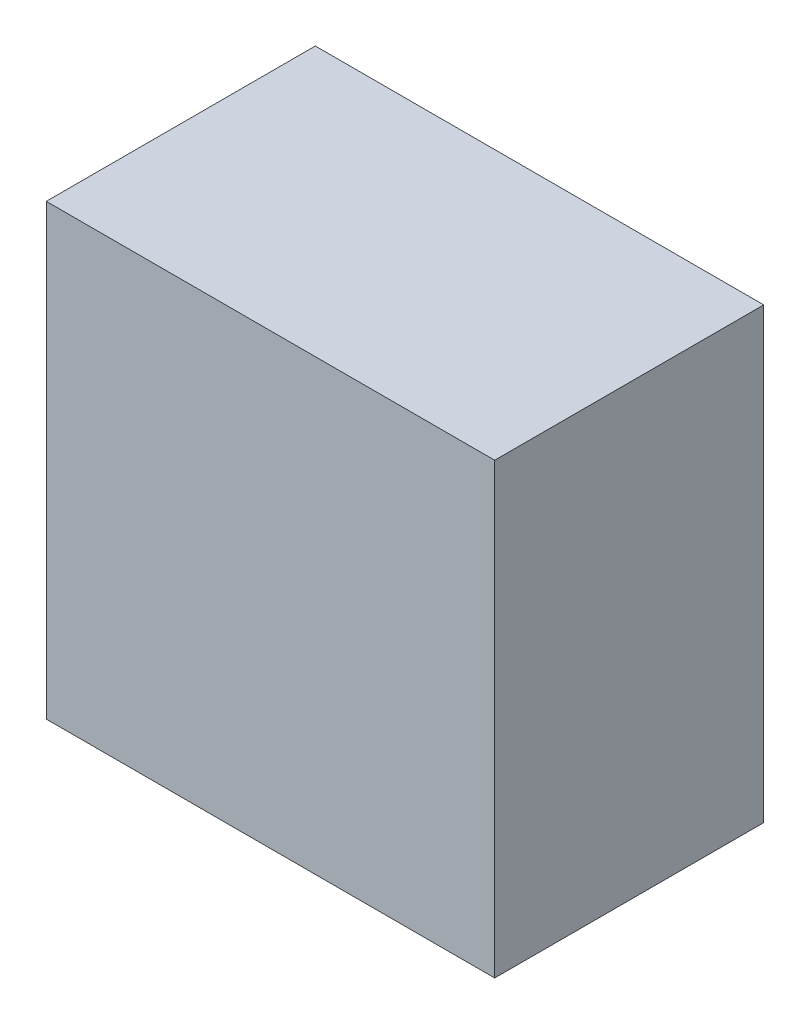
ISO-10303-21;
HEADER;
FILE_DESCRIPTION(('STEP AP214'),'2;1');
FILE_NAME('part.step','',(''),(''),'','','');
FILE_SCHEMA(('AUTOMOTIVE_DESIGN { 1 0 10303 214 1 1 1 1 }'));
ENDSEC;
DATA;
#1=APPLICATION_CONTEXT('core data for automotive mechanical design processes');
#2=APPLICATION_PROTOCOL_DEFINITION('international standard','automotive_design',2000,#1);
#3=PRODUCT_CONTEXT('',#1,'mechanical');
#4=PRODUCT('Part','Part','',(#3));
#5=PRODUCT_RELATED_PRODUCT_CATEGORY('part','',(#4));
#6=PRODUCT_DEFINITION_FORMATION('','',#4);
#7=PRODUCT_DEFINITION_CONTEXT('part definition',#1,'design');
#8=PRODUCT_DEFINITION('design','',#6,#7);
#9=PRODUCT_DEFINITION_SHAPE('','',#8);
#10=(LENGTH_UNIT() NAMED_UNIT(*) SI_UNIT(.MILLI.,.METRE.));
#11=(NAMED_UNIT(*) PLANE_ANGLE_UNIT() SI_UNIT($,.RADIAN.));
#12=(NAMED_UNIT(*) SI_UNIT($,.STERADIAN.) SOLID_ANGLE_UNIT());
#13=UNCERTAINTY_MEASURE_WITH_UNIT(LENGTH_MEASURE(1.E-05),#10,'distance_accuracy_value','');
#14=(GEOMETRIC_REPRESENTATION_CONTEXT(3) GLOBAL_UNCERTAINTY_ASSIGNED_CONTEXT((#13)) GLOBAL_UNIT_ASSIGNED_CONTEXT((#10,
#11,#12)) REPRESENTATION_CONTEXT('',''));
#15=CARTESIAN_POINT('',(0.,0.,0.));
#16=DIRECTION('',(0.,0.,1.));
#17=DIRECTION('',(1.,0.,0.));
#18=AXIS2_PLACEMENT_3D('',#15,#16,#17);
#19=CARTESIAN_POINT('',(7.80141843971632,-21.6312056737589,-30.));
#20=DIRECTION('',(-1.,0.,0.));
#21=DIRECTION('',(0.,0.,1.));
#22=AXIS2_PLACEMENT_3D('',#19,#20,#21);
#23=PLANE('',#22);
#24=DIRECTION('',(0.,-1.,0.));
#25=VECTOR('',#24,1.);
#26=CARTESIAN_POINT('',(7.80141843971632,-21.6312056737589,0.));
#27=LINE('',#26,#25);
#28=CARTESIAN_POINT('',(7.80141843971632,28.3687943262411,0.));
#29=VERTEX_POINT('',#28);
#30=CARTESIAN_POINT('',(7.80141843971632,-21.6312056737589,0.));
#31=VERTEX_POINT('',#30);
#32=EDGE_CURVE('E140',#29,#31,#27,.T.);
#33=ORIENTED_EDGE('',*,*,#32,.F.);
#34=DIRECTION('',(0.,0.,1.));
#35=VECTOR('',#34,1.);
#36=CARTESIAN_POINT('',(7.80141843971632,28.3687943262411,-30.));
#37=LINE('',#36,#35);
#38=CARTESIAN_POINT('',(7.80141843971632,28.3687943262411,-30.));
#39=VERTEX_POINT('',#38);
#40=EDGE_CURVE('E11',#39,#29,#37,.T.);
#41=ORIENTED_EDGE('',*,*,#40,.F.);
#42=DIRECTION('',(0.,-1.,0.));
#43=VECTOR('',#42,1.);
#44=CARTESIAN_POINT('',(7.80141843971632,-21.6312056737589,-30.));
#45=LINE('',#44,#43);
#46=CARTESIAN_POINT('',(7.80141843971632,-21.6312056737589,-30.));
#47=VERTEX_POINT('',#46);
#48=EDGE_CURVE('E144',#39,#47,#45,.T.);
#49=ORIENTED_EDGE('',*,*,#48,.T.);
#50=DIRECTION('',(0.,0.,1.));
#51=VECTOR('',#50,1.);
#52=CARTESIAN_POINT('',(7.80141843971632,-21.6312056737589,-30.));
#53=LINE('',#52,#51);
#54=EDGE_CURVE('E36',#47,#31,#53,.T.);
#55=ORIENTED_EDGE('',*,*,#54,.T.);
#56=EDGE_LOOP('',(#33,#41,#49,#55));
#57=FACE_BOUND('',#56,.T.);
#58=ADVANCED_FACE('F33',(#57),#23,.T.);
#59=CARTESIAN_POINT('',(7.80141843971632,28.3687943262411,-30.));
#60=DIRECTION('',(0.,1.,0.));
#61=DIRECTION('',(0.,0.,1.));
#62=AXIS2_PLACEMENT_3D('',#59,#60,#61);
#63=PLANE('',#62);
#64=DIRECTION('',(-1.,0.,0.));
#65=VECTOR('',#64,1.);
#66=CARTESIAN_POINT('',(7.80141843971632,28.3687943262411,0.));
#67=LINE('',#66,#65);
#68=CARTESIAN_POINT('',(57.8014184397163,28.3687943262411,0.));
#69=VERTEX_POINT('',#68);
#70=EDGE_CURVE('E147',#69,#29,#67,.T.);
#71=ORIENTED_EDGE('',*,*,#70,.F.);
#72=DIRECTION('',(0.,0.,1.));
#73=VECTOR('',#72,1.);
#74=CARTESIAN_POINT('',(57.8014184397163,28.3687943262411,-30.));
#75=LINE('',#74,#73);
#76=CARTESIAN_POINT('',(57.8014184397163,28.3687943262411,-30.));
#77=VERTEX_POINT('',#76);
#78=EDGE_CURVE('E41',#77,#69,#75,.T.);
#79=ORIENTED_EDGE('',*,*,#78,.F.);
#80=DIRECTION('',(-1.,0.,0.));
#81=VECTOR('',#80,1.);
#82=CARTESIAN_POINT('',(7.80141843971632,28.3687943262411,-30.));
#83=LINE('',#82,#81);
#84=EDGE_CURVE('E152',#77,#39,#83,.T.);
#85=ORIENTED_EDGE('',*,*,#84,.T.);
#86=ORIENTED_EDGE('',*,*,#40,.T.);
#87=EDGE_LOOP('',(#71,#79,#85,#86));
#88=FACE_BOUND('',#87,.T.);
#89=ADVANCED_FACE('F169',(#88),#63,.T.);
#90=CARTESIAN_POINT('',(57.8014184397163,-21.6312056737589,-30.));
#91=DIRECTION('',(1.,0.,0.));
#92=DIRECTION('',(0.,0.,-1.));
#93=AXIS2_PLACEMENT_3D('',#90,#91,#92);
#94=PLANE('',#93);
#95=DIRECTION('',(0.,1.,0.));
#96=VECTOR('',#95,1.);
#97=CARTESIAN_POINT('',(57.8014184397163,-21.6312056737589,0.));
#98=LINE('',#97,#96);
#99=CARTESIAN_POINT('',(57.8014184397163,-21.6312056737589,0.));
#100=VERTEX_POINT('',#99);
#101=EDGE_CURVE('E159',#100,#69,#98,.T.);
#102=ORIENTED_EDGE('',*,*,#101,.F.);
#103=DIRECTION('',(0.,0.,1.));
#104=VECTOR('',#103,1.);
#105=CARTESIAN_POINT('',(57.8014184397163,-21.6312056737589,-30.));
#106=LINE('',#105,#104);
#107=CARTESIAN_POINT('',(57.8014184397163,-21.6312056737589,-30.));
#108=VERTEX_POINT('',#107);
#109=EDGE_CURVE('E164',#108,#100,#106,.T.);
#110=ORIENTED_EDGE('',*,*,#109,.F.);
#111=DIRECTION('',(0.,1.,0.));
#112=VECTOR('',#111,1.);
#113=CARTESIAN_POINT('',(57.8014184397163,-21.6312056737589,-30.));
#114=LINE('',#113,#112);
#115=EDGE_CURVE('E149',#108,#77,#114,.T.);
#116=ORIENTED_EDGE('',*,*,#115,.T.);
#117=ORIENTED_EDGE('',*,*,#78,.T.);
#118=EDGE_LOOP('',(#102,#110,#116,#117));
#119=FACE_BOUND('',#118,.T.);
#120=ADVANCED_FACE('F173',(#119),#94,.T.);
#121=CARTESIAN_POINT('',(7.80141843971632,-21.6312056737589,-30.));
#122=DIRECTION('',(0.,-1.,0.));
#123=DIRECTION('',(0.,0.,-1.));
#124=AXIS2_PLACEMENT_3D('',#121,#122,#123);
#125=PLANE('',#124);
#126=DIRECTION('',(1.,0.,0.));
#127=VECTOR('',#126,1.);
#128=CARTESIAN_POINT('',(7.80141843971632,-21.6312056737589,0.));
#129=LINE('',#128,#127);
#130=EDGE_CURVE('E156',#31,#100,#129,.T.);
#131=ORIENTED_EDGE('',*,*,#130,.F.);
#132=ORIENTED_EDGE('',*,*,#54,.F.);
#133=DIRECTION('',(1.,0.,0.));
#134=VECTOR('',#133,1.);
#135=CARTESIAN_POINT('',(7.80141843971632,-21.6312056737589,-30.));
#136=LINE('',#135,#134);
#137=EDGE_CURVE('E146',#47,#108,#136,.T.);
#138=ORIENTED_EDGE('',*,*,#137,.T.);
#139=ORIENTED_EDGE('',*,*,#109,.T.);
#140=EDGE_LOOP('',(#131,#132,#138,#139));
#141=FACE_BOUND('',#140,.T.);
#142=ADVANCED_FACE('F166',(#141),#125,.T.);
#143=CARTESIAN_POINT('',(0.,0.,-30.));
#144=DIRECTION('',(0.,0.,-1.));
#145=DIRECTION('',(-1.,0.,0.));
#146=AXIS2_PLACEMENT_3D('',#143,#144,#145);
#147=PLANE('',#146);
#148=DIRECTION('',(0.,1.,0.));
#149=VECTOR('',#148,1.);
#150=CARTESIAN_POINT('',(10.3014184397163,-19.1312056737589,-30.));
#151=LINE('',#150,#149);
#152=CARTESIAN_POINT('',(10.3014184397163,-19.1312056737589,-30.));
#153=VERTEX_POINT('',#152);
#154=CARTESIAN_POINT('',(10.3014184397163,25.8687943262411,-30.));
#155=VERTEX_POINT('',#154);
#156=EDGE_CURVE('E49',#153,#155,#151,.T.);
#157=ORIENTED_EDGE('',*,*,#156,.F.);
#158=DIRECTION('',(-1.,0.,0.));
#159=VECTOR('',#158,1.);
#160=CARTESIAN_POINT('',(10.3014184397163,-19.1312056737589,-30.));
#161=LINE('',#160,#159);
#162=CARTESIAN_POINT('',(55.3014184397163,-19.1312056737589,-30.));
#163=VERTEX_POINT('',#162);
#164=EDGE_CURVE('E125',#163,#153,#161,.T.);
#165=ORIENTED_EDGE('',*,*,#164,.F.);
#166=DIRECTION('',(0.,-1.,0.));
#167=VECTOR('',#166,1.);
#168=CARTESIAN_POINT('',(55.3014184397163,-19.1312056737589,-30.));
#169=LINE('',#168,#167);
#170=CARTESIAN_POINT('',(55.3014184397163,25.8687943262411,-30.));
#171=VERTEX_POINT('',#170);
#172=EDGE_CURVE('E128',#171,#163,#169,.T.);
#173=ORIENTED_EDGE('',*,*,#172,.F.);
#174=DIRECTION('',(1.,0.,0.));
#175=VECTOR('',#174,1.);
#176=CARTESIAN_POINT('',(10.3014184397163,25.8687943262411,-30.));
#177=LINE('',#176,#175);
#178=EDGE_CURVE('E134',#155,#171,#177,.T.);
#179=ORIENTED_EDGE('',*,*,#178,.F.);
#180=EDGE_LOOP('',(#157,#165,#173,#179));
#181=FACE_BOUND('',#180,.T.);
#182=ORIENTED_EDGE('',*,*,#48,.F.);
#183=ORIENTED_EDGE('',*,*,#84,.F.);
#184=ORIENTED_EDGE('',*,*,#115,.F.);
#185=ORIENTED_EDGE('',*,*,#137,.F.);
#186=EDGE_LOOP('',(#182,#183,#184,#185));
#187=FACE_BOUND('',#186,.T.);
#188=ADVANCED_FACE('F175',(#181,#187),#147,.T.);
#189=CARTESIAN_POINT('',(0.,0.,0.));
#190=DIRECTION('',(0.,0.,-1.));
#191=DIRECTION('',(-1.,0.,0.));
#192=AXIS2_PLACEMENT_3D('',#189,#190,#191);
#193=PLANE('',#192);
#194=ORIENTED_EDGE('',*,*,#32,.T.);
#195=ORIENTED_EDGE('',*,*,#130,.T.);
#196=ORIENTED_EDGE('',*,*,#101,.T.);
#197=ORIENTED_EDGE('',*,*,#70,.T.);
#198=EDGE_LOOP('',(#194,#195,#196,#197));
#199=FACE_BOUND('',#198,.T.);
#200=ADVANCED_FACE('F168',(#199),#193,.F.);
#201=CARTESIAN_POINT('',(10.3014184397163,-19.1312056737589,-3.));
#202=DIRECTION('',(-1.,0.,0.));
#203=DIRECTION('',(0.,0.,1.));
#204=AXIS2_PLACEMENT_3D('',#201,#202,#203);
#205=PLANE('',#204);
#206=ORIENTED_EDGE('',*,*,#156,.T.);
#207=DIRECTION('',(0.,0.,-1.));
#208=VECTOR('',#207,1.);
#209=CARTESIAN_POINT('',(10.3014184397163,25.8687943262411,-3.));
#210=LINE('',#209,#208);
#211=CARTESIAN_POINT('',(10.3014184397163,25.8687943262411,-3.));
#212=VERTEX_POINT('',#211);
#213=EDGE_CURVE('E103',#212,#155,#210,.T.);
#214=ORIENTED_EDGE('',*,*,#213,.F.);
#215=DIRECTION('',(0.,1.,0.));
#216=VECTOR('',#215,1.);
#217=CARTESIAN_POINT('',(10.3014184397163,-19.1312056737589,-3.));
#218=LINE('',#217,#216);
#219=CARTESIAN_POINT('',(10.3014184397163,-19.1312056737589,-3.));
#220=VERTEX_POINT('',#219);
#221=EDGE_CURVE('E107',#220,#212,#218,.T.);
#222=ORIENTED_EDGE('',*,*,#221,.F.);
#223=DIRECTION('',(0.,0.,-1.));
#224=VECTOR('',#223,1.);
#225=CARTESIAN_POINT('',(10.3014184397163,-19.1312056737589,-3.));
#226=LINE('',#225,#224);
#227=EDGE_CURVE('E138',#220,#153,#226,.T.);
#228=ORIENTED_EDGE('',*,*,#227,.T.);
#229=EDGE_LOOP('',(#206,#214,#222,#228));
#230=FACE_BOUND('',#229,.T.);
#231=ADVANCED_FACE('F105',(#230),#205,.F.);
#232=CARTESIAN_POINT('',(10.3014184397163,-19.1312056737589,-3.));
#233=DIRECTION('',(0.,-1.,0.));
#234=DIRECTION('',(1.,0.,0.));
#235=AXIS2_PLACEMENT_3D('',#232,#233,#234);
#236=PLANE('',#235);
#237=ORIENTED_EDGE('',*,*,#164,.T.);
#238=ORIENTED_EDGE('',*,*,#227,.F.);
#239=DIRECTION('',(-1.,0.,0.));
#240=VECTOR('',#239,1.);
#241=CARTESIAN_POINT('',(10.3014184397163,-19.1312056737589,-3.));
#242=LINE('',#241,#240);
#243=CARTESIAN_POINT('',(55.3014184397163,-19.1312056737589,-3.));
#244=VERTEX_POINT('',#243);
#245=EDGE_CURVE('E113',#244,#220,#242,.T.);
#246=ORIENTED_EDGE('',*,*,#245,.F.);
#247=DIRECTION('',(0.,0.,-1.));
#248=VECTOR('',#247,1.);
#249=CARTESIAN_POINT('',(55.3014184397163,-19.1312056737589,-3.));
#250=LINE('',#249,#248);
#251=EDGE_CURVE('E141',#244,#163,#250,.T.);
#252=ORIENTED_EDGE('',*,*,#251,.T.);
#253=EDGE_LOOP('',(#237,#238,#246,#252));
#254=FACE_BOUND('',#253,.T.);
#255=ADVANCED_FACE('F219',(#254),#236,.F.);
#256=CARTESIAN_POINT('',(55.3014184397163,-19.1312056737589,-3.));
#257=DIRECTION('',(1.,0.,0.));
#258=DIRECTION('',(0.,0.,-1.));
#259=AXIS2_PLACEMENT_3D('',#256,#257,#258);
#260=PLANE('',#259);
#261=ORIENTED_EDGE('',*,*,#172,.T.);
#262=ORIENTED_EDGE('',*,*,#251,.F.);
#263=DIRECTION('',(0.,-1.,0.));
#264=VECTOR('',#263,1.);
#265=CARTESIAN_POINT('',(55.3014184397163,-19.1312056737589,-3.));
#266=LINE('',#265,#264);
#267=CARTESIAN_POINT('',(55.3014184397163,25.8687943262411,-3.));
#268=VERTEX_POINT('',#267);
#269=EDGE_CURVE('E121',#268,#244,#266,.T.);
#270=ORIENTED_EDGE('',*,*,#269,.F.);
#271=DIRECTION('',(0.,0.,-1.));
#272=VECTOR('',#271,1.);
#273=CARTESIAN_POINT('',(55.3014184397163,25.8687943262411,-3.));
#274=LINE('',#273,#272);
#275=EDGE_CURVE('E112',#268,#171,#274,.T.);
#276=ORIENTED_EDGE('',*,*,#275,.T.);
#277=EDGE_LOOP('',(#261,#262,#270,#276));
#278=FACE_BOUND('',#277,.T.);
#279=ADVANCED_FACE('F227',(#278),#260,.F.);
#280=CARTESIAN_POINT('',(10.3014184397163,25.8687943262411,-3.));
#281=DIRECTION('',(0.,1.,0.));
#282=DIRECTION('',(-1.,0.,0.));
#283=AXIS2_PLACEMENT_3D('',#280,#281,#282);
#284=PLANE('',#283);
#285=ORIENTED_EDGE('',*,*,#178,.T.);
#286=ORIENTED_EDGE('',*,*,#275,.F.);
#287=DIRECTION('',(1.,0.,0.));
#288=VECTOR('',#287,1.);
#289=CARTESIAN_POINT('',(10.3014184397163,25.8687943262411,-3.));
#290=LINE('',#289,#288);
#291=EDGE_CURVE('E116',#212,#268,#290,.T.);
#292=ORIENTED_EDGE('',*,*,#291,.F.);
#293=ORIENTED_EDGE('',*,*,#213,.T.);
#294=EDGE_LOOP('',(#285,#286,#292,#293));
#295=FACE_BOUND('',#294,.T.);
#296=ADVANCED_FACE('F117',(#295),#284,.F.);
#297=CARTESIAN_POINT('',(0.,0.,-3.));
#298=DIRECTION('',(0.,0.,-1.));
#299=DIRECTION('',(-1.,0.,0.));
#300=AXIS2_PLACEMENT_3D('',#297,#298,#299);
#301=PLANE('',#300);
#302=ORIENTED_EDGE('',*,*,#221,.T.);
#303=ORIENTED_EDGE('',*,*,#291,.T.);
#304=ORIENTED_EDGE('',*,*,#269,.T.);
#305=ORIENTED_EDGE('',*,*,#245,.T.);
#306=EDGE_LOOP('',(#302,#303,#304,#305));
#307=FACE_BOUND('',#306,.T.);
#308=ADVANCED_FACE('F123',(#307),#301,.T.);
#309=CLOSED_SHELL('',(#58,#89,#120,#142,#188,#200,#231,#255,#279,#296,#308));
#310=MANIFOLD_SOLID_BREP('B2',#309);
#311=ADVANCED_BREP_SHAPE_REPRESENTATION('',(#18,#310),#14);
#312=SHAPE_DEFINITION_REPRESENTATION(#9,#311);
ENDSEC;
END-ISO-10303-21;
